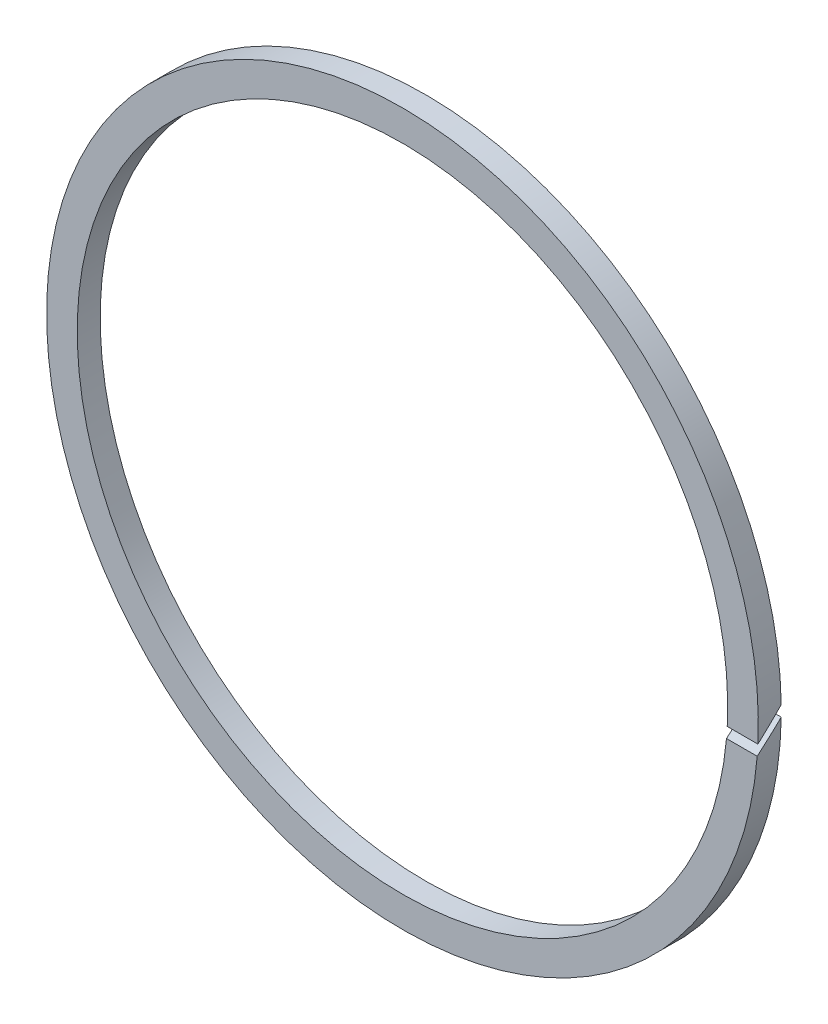
ISO-10303-21;
HEADER;
FILE_DESCRIPTION(('STEP AP214'),'2;1');
FILE_NAME('part.step','',(''),(''),'','','');
FILE_SCHEMA(('AUTOMOTIVE_DESIGN { 1 0 10303 214 1 1 1 1 }'));
ENDSEC;
DATA;
#1=APPLICATION_CONTEXT('core data for automotive mechanical design processes');
#2=APPLICATION_PROTOCOL_DEFINITION('international standard','automotive_design',2000,#1);
#3=PRODUCT_CONTEXT('',#1,'mechanical');
#4=PRODUCT('Part','Part','',(#3));
#5=PRODUCT_RELATED_PRODUCT_CATEGORY('part','',(#4));
#6=PRODUCT_DEFINITION_FORMATION('','',#4);
#7=PRODUCT_DEFINITION_CONTEXT('part definition',#1,'design');
#8=PRODUCT_DEFINITION('design','',#6,#7);
#9=PRODUCT_DEFINITION_SHAPE('','',#8);
#10=(LENGTH_UNIT() NAMED_UNIT(*) SI_UNIT(.MILLI.,.METRE.));
#11=(NAMED_UNIT(*) PLANE_ANGLE_UNIT() SI_UNIT($,.RADIAN.));
#12=(NAMED_UNIT(*) SI_UNIT($,.STERADIAN.) SOLID_ANGLE_UNIT());
#13=UNCERTAINTY_MEASURE_WITH_UNIT(LENGTH_MEASURE(1.E-05),#10,'distance_accuracy_value','');
#14=(GEOMETRIC_REPRESENTATION_CONTEXT(3) GLOBAL_UNCERTAINTY_ASSIGNED_CONTEXT((#13)) GLOBAL_UNIT_ASSIGNED_CONTEXT((#10,
#11,#12)) REPRESENTATION_CONTEXT('',''));
#15=CARTESIAN_POINT('',(0.,0.,0.));
#16=DIRECTION('',(0.,0.,1.));
#17=DIRECTION('',(1.,0.,0.));
#18=AXIS2_PLACEMENT_3D('',#15,#16,#17);
#19=CARTESIAN_POINT('',(0.,0.,3.));
#20=DIRECTION('',(0.,0.,1.));
#21=DIRECTION('',(1.,0.,0.));
#22=AXIS2_PLACEMENT_3D('',#19,#20,#21);
#23=PLANE('',#22);
#24=CARTESIAN_POINT('',(0.,0.,3.));
#25=DIRECTION('',(0.,0.,1.));
#26=DIRECTION('',(1.,0.,0.));
#27=AXIS2_PLACEMENT_3D('',#24,#25,#26);
#28=CIRCLE('',#27,42.5);
#29=CARTESIAN_POINT('',(42.438103641505,-2.29289321881348,3.));
#30=VERTEX_POINT('',#29);
#31=CARTESIAN_POINT('',(42.3380131715328,-3.70710678118658,3.));
#32=VERTEX_POINT('',#31);
#33=EDGE_CURVE('E106',#30,#32,#28,.T.);
#34=ORIENTED_EDGE('',*,*,#33,.F.);
#35=DIRECTION('',(1.,0.,0.));
#36=VECTOR('',#35,1.);
#37=CARTESIAN_POINT('',(0.,-2.29289321881348,3.));
#38=LINE('',#37,#36);
#39=CARTESIAN_POINT('',(46.4434348502253,-2.29289321881348,3.));
#40=VERTEX_POINT('',#39);
#41=EDGE_CURVE('E67',#30,#40,#38,.T.);
#42=ORIENTED_EDGE('',*,*,#41,.T.);
#43=CARTESIAN_POINT('',(0.,0.,3.));
#44=DIRECTION('',(0.,0.,1.));
#45=DIRECTION('',(1.,0.,0.));
#46=AXIS2_PLACEMENT_3D('',#43,#44,#45);
#47=CIRCLE('',#46,46.5);
#48=CARTESIAN_POINT('',(46.3519941244482,-3.70710678118658,3.00000000000001));
#49=VERTEX_POINT('',#48);
#50=EDGE_CURVE('E105',#40,#49,#47,.T.);
#51=ORIENTED_EDGE('',*,*,#50,.T.);
#52=DIRECTION('',(-1.,0.,0.));
#53=VECTOR('',#52,1.);
#54=CARTESIAN_POINT('',(0.,-3.70710678118658,3.));
#55=LINE('',#54,#53);
#56=EDGE_CURVE('E85',#49,#32,#55,.T.);
#57=ORIENTED_EDGE('',*,*,#56,.T.);
#58=EDGE_LOOP('',(#34,#42,#51,#57));
#59=FACE_BOUND('',#58,.T.);
#60=ADVANCED_FACE('F43',(#59),#23,.T.);
#61=CARTESIAN_POINT('',(0.,0.,0.));
#62=DIRECTION('',(0.,0.,1.));
#63=DIRECTION('',(1.,0.,0.));
#64=AXIS2_PLACEMENT_3D('',#61,#62,#63);
#65=PLANE('',#64);
#66=DIRECTION('',(1.,0.,0.));
#67=VECTOR('',#66,1.);
#68=CARTESIAN_POINT('',(0.,0.707106781186555,0.));
#69=LINE('',#68,#67);
#70=CARTESIAN_POINT('',(42.4941172399192,0.707106781186556,0.));
#71=VERTEX_POINT('',#70);
#72=CARTESIAN_POINT('',(46.4946233450708,0.707106781186557,0.));
#73=VERTEX_POINT('',#72);
#74=EDGE_CURVE('E122',#71,#73,#69,.T.);
#75=ORIENTED_EDGE('',*,*,#74,.F.);
#76=CARTESIAN_POINT('',(0.,0.,0.));
#77=DIRECTION('',(0.,0.,1.));
#78=DIRECTION('',(1.,0.,0.));
#79=AXIS2_PLACEMENT_3D('',#76,#77,#78);
#80=CIRCLE('',#79,42.5);
#81=CARTESIAN_POINT('',(42.4941172399192,-0.707106781186539,0.));
#82=VERTEX_POINT('',#81);
#83=EDGE_CURVE('E100',#71,#82,#80,.T.);
#84=ORIENTED_EDGE('',*,*,#83,.T.);
#85=DIRECTION('',(-1.,0.,0.));
#86=VECTOR('',#85,1.);
#87=CARTESIAN_POINT('',(0.,-0.707106781186538,0.));
#88=LINE('',#87,#86);
#89=CARTESIAN_POINT('',(46.4946233450708,-0.707106781186563,0.));
#90=VERTEX_POINT('',#89);
#91=EDGE_CURVE('E59',#90,#82,#88,.T.);
#92=ORIENTED_EDGE('',*,*,#91,.F.);
#93=CARTESIAN_POINT('',(0.,0.,0.));
#94=DIRECTION('',(0.,0.,1.));
#95=DIRECTION('',(1.,0.,0.));
#96=AXIS2_PLACEMENT_3D('',#93,#94,#95);
#97=CIRCLE('',#96,46.5);
#98=EDGE_CURVE('E98',#73,#90,#97,.T.);
#99=ORIENTED_EDGE('',*,*,#98,.F.);
#100=EDGE_LOOP('',(#75,#84,#92,#99));
#101=FACE_BOUND('',#100,.T.);
#102=ADVANCED_FACE('F97',(#101),#65,.F.);
#103=CARTESIAN_POINT('',(0.,0.,3.));
#104=DIRECTION('',(0.,0.,-1.));
#105=DIRECTION('',(-1.,0.,0.));
#106=AXIS2_PLACEMENT_3D('',#103,#104,#105);
#107=CYLINDRICAL_SURFACE('',#106,46.5);
#108=CARTESIAN_POINT('',(0.,0.,0.707106781186548));
#109=DIRECTION('',(0.,-0.707106781186543,-0.707106781186552));
#110=DIRECTION('',(0.,0.707106781186552,-0.707106781186543));
#111=AXIS2_PLACEMENT_3D('',#108,#109,#110);
#112=ELLIPSE('',#111,65.7609306503485,46.5);
#113=EDGE_CURVE('E91',#40,#73,#112,.F.);
#114=ORIENTED_EDGE('',*,*,#113,.T.);
#115=ORIENTED_EDGE('',*,*,#98,.T.);
#116=CARTESIAN_POINT('',(0.,0.,-0.70710678118653));
#117=DIRECTION('',(0.,0.707106781186543,0.707106781186552));
#118=DIRECTION('',(0.,0.707106781186552,-0.707106781186543));
#119=AXIS2_PLACEMENT_3D('',#116,#117,#118);
#120=ELLIPSE('',#119,65.7609306503485,46.5);
#121=EDGE_CURVE('E82',#90,#49,#120,.F.);
#122=ORIENTED_EDGE('',*,*,#121,.T.);
#123=ORIENTED_EDGE('',*,*,#50,.F.);
#124=EDGE_LOOP('',(#114,#115,#122,#123));
#125=FACE_BOUND('',#124,.T.);
#126=ADVANCED_FACE('F45',(#125),#107,.T.);
#127=CARTESIAN_POINT('',(0.,0.,3.));
#128=DIRECTION('',(0.,0.,-1.));
#129=DIRECTION('',(-1.,0.,0.));
#130=AXIS2_PLACEMENT_3D('',#127,#128,#129);
#131=CYLINDRICAL_SURFACE('',#130,42.5);
#132=ORIENTED_EDGE('',*,*,#83,.F.);
#133=CARTESIAN_POINT('',(0.,0.,0.707106781186548));
#134=DIRECTION('',(0.,-0.707106781186543,-0.707106781186552));
#135=DIRECTION('',(0.,0.707106781186552,-0.707106781186543));
#136=AXIS2_PLACEMENT_3D('',#133,#134,#135);
#137=ELLIPSE('',#136,60.1040764008562,42.5);
#138=EDGE_CURVE('E11',#71,#30,#137,.T.);
#139=ORIENTED_EDGE('',*,*,#138,.T.);
#140=ORIENTED_EDGE('',*,*,#33,.T.);
#141=CARTESIAN_POINT('',(0.,0.,-0.70710678118653));
#142=DIRECTION('',(0.,0.707106781186543,0.707106781186552));
#143=DIRECTION('',(0.,0.707106781186552,-0.707106781186543));
#144=AXIS2_PLACEMENT_3D('',#141,#142,#143);
#145=ELLIPSE('',#144,60.1040764008562,42.5);
#146=EDGE_CURVE('E52',#32,#82,#145,.T.);
#147=ORIENTED_EDGE('',*,*,#146,.T.);
#148=EDGE_LOOP('',(#132,#139,#140,#147));
#149=FACE_BOUND('',#148,.T.);
#150=ADVANCED_FACE('F119',(#149),#131,.F.);
#151=CARTESIAN_POINT('',(46.501,-14.6088881202805,13.9017813390938));
#152=DIRECTION('',(0.,0.707106781186543,0.707106781186552));
#153=DIRECTION('',(0.,-0.707106781186552,0.707106781186543));
#154=AXIS2_PLACEMENT_3D('',#151,#152,#153);
#155=PLANE('',#154);
#156=ORIENTED_EDGE('',*,*,#121,.F.);
#157=ORIENTED_EDGE('',*,*,#91,.T.);
#158=ORIENTED_EDGE('',*,*,#146,.F.);
#159=ORIENTED_EDGE('',*,*,#56,.F.);
#160=EDGE_LOOP('',(#156,#157,#158,#159));
#161=FACE_BOUND('',#160,.T.);
#162=ADVANCED_FACE('F83',(#161),#155,.T.);
#163=CARTESIAN_POINT('',(46.501,-13.901781339094,14.6088881202804));
#164=DIRECTION('',(0.,-0.707106781186543,-0.707106781186552));
#165=DIRECTION('',(0.,0.707106781186552,-0.707106781186543));
#166=AXIS2_PLACEMENT_3D('',#163,#164,#165);
#167=PLANE('',#166);
#168=ORIENTED_EDGE('',*,*,#138,.F.);
#169=ORIENTED_EDGE('',*,*,#74,.T.);
#170=ORIENTED_EDGE('',*,*,#113,.F.);
#171=ORIENTED_EDGE('',*,*,#41,.F.);
#172=EDGE_LOOP('',(#168,#169,#170,#171));
#173=FACE_BOUND('',#172,.T.);
#174=ADVANCED_FACE('F129',(#173),#167,.T.);
#175=CLOSED_SHELL('',(#60,#102,#126,#150,#162,#174));
#176=MANIFOLD_SOLID_BREP('B2',#175);
#177=ADVANCED_BREP_SHAPE_REPRESENTATION('',(#18,#176),#14);
#178=SHAPE_DEFINITION_REPRESENTATION(#9,#177);
ENDSEC;
END-ISO-10303-21;
